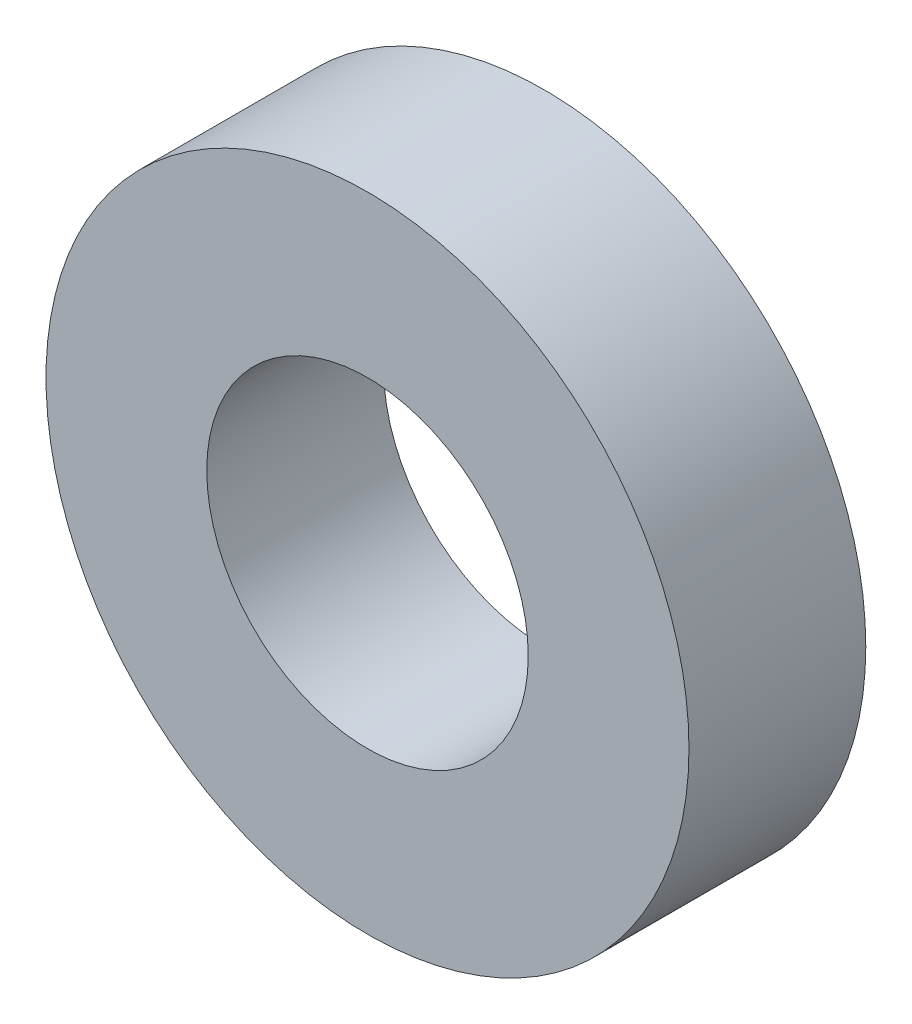
ISO-10303-21;
HEADER;
FILE_DESCRIPTION(('STEP AP214'),'2;1');
FILE_NAME('part.step','',(''),(''),'','','');
FILE_SCHEMA(('AUTOMOTIVE_DESIGN { 1 0 10303 214 1 1 1 1 }'));
ENDSEC;
DATA;
#1=APPLICATION_CONTEXT('core data for automotive mechanical design processes');
#2=APPLICATION_PROTOCOL_DEFINITION('international standard','automotive_design',2000,#1);
#3=PRODUCT_CONTEXT('',#1,'mechanical');
#4=PRODUCT('Part','Part','',(#3));
#5=PRODUCT_RELATED_PRODUCT_CATEGORY('part','',(#4));
#6=PRODUCT_DEFINITION_FORMATION('','',#4);
#7=PRODUCT_DEFINITION_CONTEXT('part definition',#1,'design');
#8=PRODUCT_DEFINITION('design','',#6,#7);
#9=PRODUCT_DEFINITION_SHAPE('','',#8);
#10=(LENGTH_UNIT() NAMED_UNIT(*) SI_UNIT(.MILLI.,.METRE.));
#11=(NAMED_UNIT(*) PLANE_ANGLE_UNIT() SI_UNIT($,.RADIAN.));
#12=(NAMED_UNIT(*) SI_UNIT($,.STERADIAN.) SOLID_ANGLE_UNIT());
#13=UNCERTAINTY_MEASURE_WITH_UNIT(LENGTH_MEASURE(1.E-05),#10,'distance_accuracy_value','');
#14=(GEOMETRIC_REPRESENTATION_CONTEXT(3) GLOBAL_UNCERTAINTY_ASSIGNED_CONTEXT((#13)) GLOBAL_UNIT_ASSIGNED_CONTEXT((#10,
#11,#12)) REPRESENTATION_CONTEXT('',''));
#15=CARTESIAN_POINT('',(0.,0.,0.));
#16=DIRECTION('',(0.,0.,1.));
#17=DIRECTION('',(1.,0.,0.));
#18=AXIS2_PLACEMENT_3D('',#15,#16,#17);
#19=CARTESIAN_POINT('',(0.,0.,5.5));
#20=DIRECTION('',(0.,0.,1.));
#21=DIRECTION('',(1.,0.,0.));
#22=AXIS2_PLACEMENT_3D('',#19,#20,#21);
#23=PLANE('',#22);
#24=CARTESIAN_POINT('',(0.,0.,5.5));
#25=DIRECTION('',(0.,0.,1.));
#26=DIRECTION('',(1.,0.,0.));
#27=AXIS2_PLACEMENT_3D('',#24,#25,#26);
#28=CIRCLE('',#27,10.);
#29=CARTESIAN_POINT('',(10.,0.,5.5));
#30=VERTEX_POINT('',#29);
#31=EDGE_CURVE('E10',#30,#30,#28,.T.);
#32=ORIENTED_EDGE('',*,*,#31,.T.);
#33=EDGE_LOOP('',(#32));
#34=FACE_BOUND('',#33,.T.);
#35=CARTESIAN_POINT('',(0.,0.,5.5));
#36=DIRECTION('',(0.,0.,1.));
#37=DIRECTION('',(1.,0.,0.));
#38=AXIS2_PLACEMENT_3D('',#35,#36,#37);
#39=CIRCLE('',#38,5.);
#40=CARTESIAN_POINT('',(5.,0.,5.5));
#41=VERTEX_POINT('',#40);
#42=EDGE_CURVE('E48',#41,#41,#39,.T.);
#43=ORIENTED_EDGE('',*,*,#42,.F.);
#44=EDGE_LOOP('',(#43));
#45=FACE_BOUND('',#44,.T.);
#46=ADVANCED_FACE('F37',(#34,#45),#23,.T.);
#47=CARTESIAN_POINT('',(0.,0.,0.));
#48=DIRECTION('',(0.,0.,1.));
#49=DIRECTION('',(1.,0.,0.));
#50=AXIS2_PLACEMENT_3D('',#47,#48,#49);
#51=PLANE('',#50);
#52=CARTESIAN_POINT('',(0.,0.,0.));
#53=DIRECTION('',(0.,0.,1.));
#54=DIRECTION('',(1.,0.,0.));
#55=AXIS2_PLACEMENT_3D('',#52,#53,#54);
#56=CIRCLE('',#55,10.);
#57=CARTESIAN_POINT('',(10.,0.,0.));
#58=VERTEX_POINT('',#57);
#59=EDGE_CURVE('E41',#58,#58,#56,.T.);
#60=ORIENTED_EDGE('',*,*,#59,.F.);
#61=EDGE_LOOP('',(#60));
#62=FACE_BOUND('',#61,.T.);
#63=CARTESIAN_POINT('',(0.,0.,0.));
#64=DIRECTION('',(0.,0.,1.));
#65=DIRECTION('',(1.,0.,0.));
#66=AXIS2_PLACEMENT_3D('',#63,#64,#65);
#67=CIRCLE('',#66,5.);
#68=CARTESIAN_POINT('',(5.,0.,0.));
#69=VERTEX_POINT('',#68);
#70=EDGE_CURVE('E50',#69,#69,#67,.T.);
#71=ORIENTED_EDGE('',*,*,#70,.T.);
#72=EDGE_LOOP('',(#71));
#73=FACE_BOUND('',#72,.T.);
#74=ADVANCED_FACE('F60',(#62,#73),#51,.F.);
#75=CARTESIAN_POINT('',(0.,0.,5.5));
#76=DIRECTION('',(0.,0.,-1.));
#77=DIRECTION('',(-1.,0.,0.));
#78=AXIS2_PLACEMENT_3D('',#75,#76,#77);
#79=CYLINDRICAL_SURFACE('',#78,10.);
#80=ORIENTED_EDGE('',*,*,#31,.F.);
#81=EDGE_LOOP('',(#80));
#82=FACE_BOUND('',#81,.T.);
#83=ORIENTED_EDGE('',*,*,#59,.T.);
#84=EDGE_LOOP('',(#83));
#85=FACE_BOUND('',#84,.T.);
#86=ADVANCED_FACE('F39',(#82,#85),#79,.T.);
#87=CARTESIAN_POINT('',(0.,0.,5.5));
#88=DIRECTION('',(0.,0.,-1.));
#89=DIRECTION('',(-1.,0.,0.));
#90=AXIS2_PLACEMENT_3D('',#87,#88,#89);
#91=CYLINDRICAL_SURFACE('',#90,5.);
#92=ORIENTED_EDGE('',*,*,#42,.T.);
#93=EDGE_LOOP('',(#92));
#94=FACE_BOUND('',#93,.T.);
#95=ORIENTED_EDGE('',*,*,#70,.F.);
#96=EDGE_LOOP('',(#95));
#97=FACE_BOUND('',#96,.T.);
#98=ADVANCED_FACE('F56',(#94,#97),#91,.F.);
#99=CLOSED_SHELL('',(#46,#74,#86,#98));
#100=MANIFOLD_SOLID_BREP('B2',#99);
#101=ADVANCED_BREP_SHAPE_REPRESENTATION('',(#18,#100),#14);
#102=SHAPE_DEFINITION_REPRESENTATION(#9,#101);
ENDSEC;
END-ISO-10303-21;
